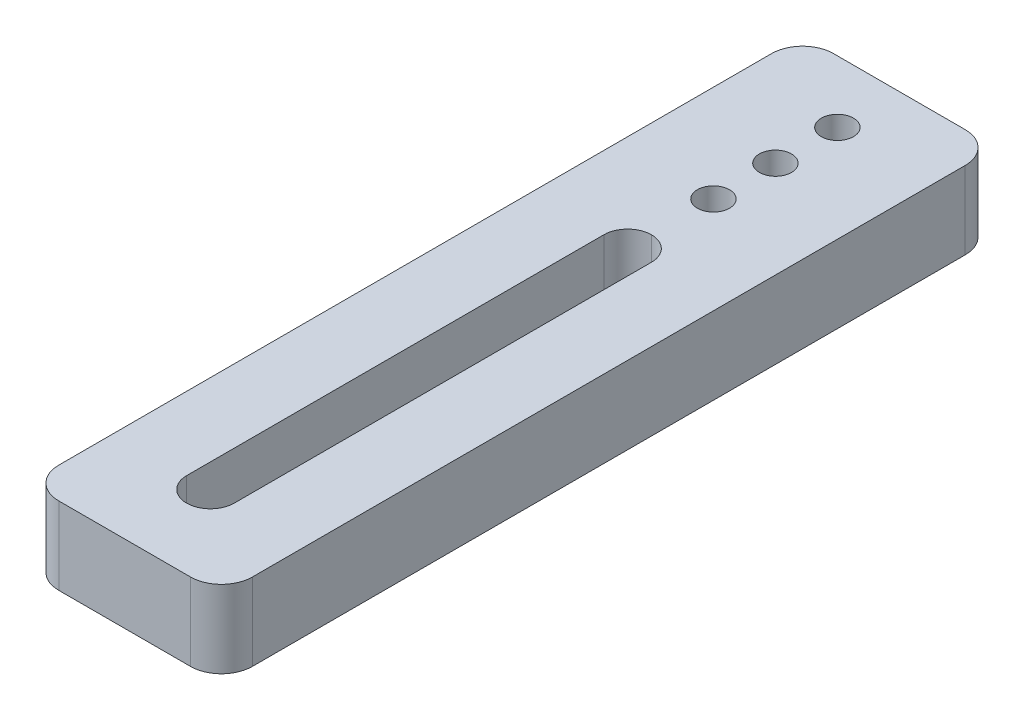
ISO-10303-21;
HEADER;
FILE_DESCRIPTION(('STEP AP214'),'2;1');
FILE_NAME('part.step','',(''),(''),'','','');
FILE_SCHEMA(('AUTOMOTIVE_DESIGN { 1 0 10303 214 1 1 1 1 }'));
ENDSEC;
DATA;
#1=APPLICATION_CONTEXT('core data for automotive mechanical design processes');
#2=APPLICATION_PROTOCOL_DEFINITION('international standard','automotive_design',2000,#1);
#3=PRODUCT_CONTEXT('',#1,'mechanical');
#4=PRODUCT('Part','Part','',(#3));
#5=PRODUCT_RELATED_PRODUCT_CATEGORY('part','',(#4));
#6=PRODUCT_DEFINITION_FORMATION('','',#4);
#7=PRODUCT_DEFINITION_CONTEXT('part definition',#1,'design');
#8=PRODUCT_DEFINITION('design','',#6,#7);
#9=PRODUCT_DEFINITION_SHAPE('','',#8);
#10=(LENGTH_UNIT() NAMED_UNIT(*) SI_UNIT(.MILLI.,.METRE.));
#11=(NAMED_UNIT(*) PLANE_ANGLE_UNIT() SI_UNIT($,.RADIAN.));
#12=(NAMED_UNIT(*) SI_UNIT($,.STERADIAN.) SOLID_ANGLE_UNIT());
#13=UNCERTAINTY_MEASURE_WITH_UNIT(LENGTH_MEASURE(1.E-05),#10,'distance_accuracy_value','');
#14=(GEOMETRIC_REPRESENTATION_CONTEXT(3) GLOBAL_UNCERTAINTY_ASSIGNED_CONTEXT((#13)) GLOBAL_UNIT_ASSIGNED_CONTEXT((#10,
#11,#12)) REPRESENTATION_CONTEXT('',''));
#15=CARTESIAN_POINT('',(0.,0.,0.));
#16=DIRECTION('',(0.,0.,1.));
#17=DIRECTION('',(1.,0.,0.));
#18=AXIS2_PLACEMENT_3D('',#15,#16,#17);
#19=CARTESIAN_POINT('',(0.,0.,-26.));
#20=DIRECTION('',(0.,1.,0.));
#21=DIRECTION('',(0.,0.,1.));
#22=AXIS2_PLACEMENT_3D('',#19,#20,#21);
#23=CYLINDRICAL_SURFACE('',#22,2.075);
#24=CARTESIAN_POINT('',(0.,0.,-26.));
#25=DIRECTION('',(0.,1.,0.));
#26=DIRECTION('',(0.,0.,1.));
#27=AXIS2_PLACEMENT_3D('',#24,#25,#26);
#28=CIRCLE('',#27,2.075);
#29=CARTESIAN_POINT('',(0.,0.,-23.925));
#30=VERTEX_POINT('',#29);
#31=EDGE_CURVE('E42',#30,#30,#28,.T.);
#32=ORIENTED_EDGE('',*,*,#31,.F.);
#33=EDGE_LOOP('',(#32));
#34=FACE_BOUND('',#33,.T.);
#35=CARTESIAN_POINT('',(0.,10.,-26.));
#36=DIRECTION('',(0.,1.,0.));
#37=DIRECTION('',(0.,0.,1.));
#38=AXIS2_PLACEMENT_3D('',#35,#36,#37);
#39=CIRCLE('',#38,2.075);
#40=CARTESIAN_POINT('',(0.,10.,-23.925));
#41=VERTEX_POINT('',#40);
#42=EDGE_CURVE('E11',#41,#41,#39,.T.);
#43=ORIENTED_EDGE('',*,*,#42,.T.);
#44=EDGE_LOOP('',(#43));
#45=FACE_BOUND('',#44,.T.);
#46=ADVANCED_FACE('F35',(#34,#45),#23,.F.);
#47=CARTESIAN_POINT('',(0.,10.,0.));
#48=DIRECTION('',(0.,-1.,0.));
#49=DIRECTION('',(0.,0.,-1.));
#50=AXIS2_PLACEMENT_3D('',#47,#48,#49);
#51=PLANE('',#50);
#52=CARTESIAN_POINT('',(0.,10.,-34.));
#53=DIRECTION('',(0.,1.,0.));
#54=DIRECTION('',(0.,0.,1.));
#55=AXIS2_PLACEMENT_3D('',#52,#53,#54);
#56=CIRCLE('',#55,2.075);
#57=CARTESIAN_POINT('',(0.,10.,-31.925));
#58=VERTEX_POINT('',#57);
#59=EDGE_CURVE('E350',#58,#58,#56,.T.);
#60=ORIENTED_EDGE('',*,*,#59,.F.);
#61=EDGE_LOOP('',(#60));
#62=FACE_BOUND('',#61,.T.);
#63=CARTESIAN_POINT('',(0.,10.,-42.));
#64=DIRECTION('',(0.,1.,0.));
#65=DIRECTION('',(0.,0.,1.));
#66=AXIS2_PLACEMENT_3D('',#63,#64,#65);
#67=CIRCLE('',#66,2.075);
#68=CARTESIAN_POINT('',(0.,10.,-39.925));
#69=VERTEX_POINT('',#68);
#70=EDGE_CURVE('E347',#69,#69,#67,.T.);
#71=ORIENTED_EDGE('',*,*,#70,.F.);
#72=EDGE_LOOP('',(#71));
#73=FACE_BOUND('',#72,.T.);
#74=DIRECTION('',(0.,0.,1.));
#75=VECTOR('',#74,1.);
#76=CARTESIAN_POINT('',(-12.5,10.,50.));
#77=LINE('',#76,#75);
#78=CARTESIAN_POINT('',(-12.5,10.,-46.));
#79=VERTEX_POINT('',#78);
#80=CARTESIAN_POINT('',(-12.5,10.,46.));
#81=VERTEX_POINT('',#80);
#82=EDGE_CURVE('E182',#79,#81,#77,.T.);
#83=ORIENTED_EDGE('',*,*,#82,.T.);
#84=CARTESIAN_POINT('',(-8.5,10.,46.));
#85=DIRECTION('',(0.,-1.,0.));
#86=DIRECTION('',(0.,0.,-1.));
#87=AXIS2_PLACEMENT_3D('',#84,#85,#86);
#88=CIRCLE('',#87,4.);
#89=CARTESIAN_POINT('',(-8.5,10.,50.));
#90=VERTEX_POINT('',#89);
#91=EDGE_CURVE('E237',#81,#90,#88,.F.);
#92=ORIENTED_EDGE('',*,*,#91,.T.);
#93=DIRECTION('',(1.,0.,0.));
#94=VECTOR('',#93,1.);
#95=CARTESIAN_POINT('',(-12.5,10.,50.));
#96=LINE('',#95,#94);
#97=CARTESIAN_POINT('',(8.5,10.,50.));
#98=VERTEX_POINT('',#97);
#99=EDGE_CURVE('E160',#90,#98,#96,.T.);
#100=ORIENTED_EDGE('',*,*,#99,.T.);
#101=CARTESIAN_POINT('',(8.5,10.,46.));
#102=DIRECTION('',(0.,-1.,0.));
#103=DIRECTION('',(0.,0.,-1.));
#104=AXIS2_PLACEMENT_3D('',#101,#102,#103);
#105=CIRCLE('',#104,4.);
#106=CARTESIAN_POINT('',(12.5,10.,46.));
#107=VERTEX_POINT('',#106);
#108=EDGE_CURVE('E235',#98,#107,#105,.F.);
#109=ORIENTED_EDGE('',*,*,#108,.T.);
#110=DIRECTION('',(0.,0.,-1.));
#111=VECTOR('',#110,1.);
#112=CARTESIAN_POINT('',(12.5,10.,50.));
#113=LINE('',#112,#111);
#114=CARTESIAN_POINT('',(12.5,10.,-46.));
#115=VERTEX_POINT('',#114);
#116=EDGE_CURVE('E177',#107,#115,#113,.T.);
#117=ORIENTED_EDGE('',*,*,#116,.T.);
#118=CARTESIAN_POINT('',(8.5,10.,-46.));
#119=DIRECTION('',(0.,-1.,0.));
#120=DIRECTION('',(0.,0.,-1.));
#121=AXIS2_PLACEMENT_3D('',#118,#119,#120);
#122=CIRCLE('',#121,4.);
#123=CARTESIAN_POINT('',(8.5,10.,-50.));
#124=VERTEX_POINT('',#123);
#125=EDGE_CURVE('E56',#115,#124,#122,.F.);
#126=ORIENTED_EDGE('',*,*,#125,.T.);
#127=DIRECTION('',(-1.,0.,0.));
#128=VECTOR('',#127,1.);
#129=CARTESIAN_POINT('',(-12.5,10.,-50.));
#130=LINE('',#129,#128);
#131=CARTESIAN_POINT('',(-8.5,10.,-50.));
#132=VERTEX_POINT('',#131);
#133=EDGE_CURVE('E179',#124,#132,#130,.T.);
#134=ORIENTED_EDGE('',*,*,#133,.T.);
#135=CARTESIAN_POINT('',(-8.5,10.,-46.));
#136=DIRECTION('',(0.,-1.,0.));
#137=DIRECTION('',(0.,0.,-1.));
#138=AXIS2_PLACEMENT_3D('',#135,#136,#137);
#139=CIRCLE('',#138,4.);
#140=EDGE_CURVE('E232',#132,#79,#139,.F.);
#141=ORIENTED_EDGE('',*,*,#140,.T.);
#142=EDGE_LOOP('',(#83,#92,#100,#109,#117,#126,#134,#141));
#143=FACE_BOUND('',#142,.T.);
#144=CARTESIAN_POINT('',(0.,10.,38.925));
#145=DIRECTION('',(0.,-1.,0.));
#146=DIRECTION('',(0.,0.,-1.));
#147=AXIS2_PLACEMENT_3D('',#144,#145,#146);
#148=CIRCLE('',#147,3.075);
#149=CARTESIAN_POINT('',(3.075,10.,38.925));
#150=VERTEX_POINT('',#149);
#151=CARTESIAN_POINT('',(0.,10.,42.));
#152=VERTEX_POINT('',#151);
#153=EDGE_CURVE('E137',#150,#152,#148,.T.);
#154=ORIENTED_EDGE('',*,*,#153,.T.);
#155=CARTESIAN_POINT('',(0.,10.,38.925));
#156=DIRECTION('',(0.,-1.,0.));
#157=DIRECTION('',(0.,0.,-1.));
#158=AXIS2_PLACEMENT_3D('',#155,#156,#157);
#159=CIRCLE('',#158,3.075);
#160=CARTESIAN_POINT('',(-3.075,10.,38.925));
#161=VERTEX_POINT('',#160);
#162=EDGE_CURVE('E207',#152,#161,#159,.T.);
#163=ORIENTED_EDGE('',*,*,#162,.T.);
#164=DIRECTION('',(0.,0.,-1.));
#165=VECTOR('',#164,1.);
#166=CARTESIAN_POINT('',(-3.075,10.,0.));
#167=LINE('',#166,#165);
#168=CARTESIAN_POINT('',(-3.075,10.,-14.925));
#169=VERTEX_POINT('',#168);
#170=EDGE_CURVE('E167',#161,#169,#167,.T.);
#171=ORIENTED_EDGE('',*,*,#170,.T.);
#172=CARTESIAN_POINT('',(0.,10.,-14.925));
#173=DIRECTION('',(0.,-1.,0.));
#174=DIRECTION('',(0.,0.,-1.));
#175=AXIS2_PLACEMENT_3D('',#172,#173,#174);
#176=CIRCLE('',#175,3.075);
#177=CARTESIAN_POINT('',(0.,10.,-18.));
#178=VERTEX_POINT('',#177);
#179=EDGE_CURVE('E203',#169,#178,#176,.T.);
#180=ORIENTED_EDGE('',*,*,#179,.T.);
#181=CARTESIAN_POINT('',(0.,10.,-14.925));
#182=DIRECTION('',(0.,-1.,0.));
#183=DIRECTION('',(0.,0.,-1.));
#184=AXIS2_PLACEMENT_3D('',#181,#182,#183);
#185=CIRCLE('',#184,3.075);
#186=CARTESIAN_POINT('',(3.075,10.,-14.925));
#187=VERTEX_POINT('',#186);
#188=EDGE_CURVE('E165',#178,#187,#185,.T.);
#189=ORIENTED_EDGE('',*,*,#188,.T.);
#190=DIRECTION('',(0.,0.,-1.));
#191=VECTOR('',#190,1.);
#192=CARTESIAN_POINT('',(3.075,10.,0.));
#193=LINE('',#192,#191);
#194=EDGE_CURVE('E155',#150,#187,#193,.T.);
#195=ORIENTED_EDGE('',*,*,#194,.F.);
#196=EDGE_LOOP('',(#154,#163,#171,#180,#189,#195));
#197=FACE_BOUND('',#196,.T.);
#198=ORIENTED_EDGE('',*,*,#42,.F.);
#199=EDGE_LOOP('',(#198));
#200=FACE_BOUND('',#199,.T.);
#201=ADVANCED_FACE('F162',(#62,#73,#143,#197,#200),#51,.F.);
#202=CARTESIAN_POINT('',(0.,0.,0.));
#203=DIRECTION('',(0.,-1.,0.));
#204=DIRECTION('',(0.,0.,-1.));
#205=AXIS2_PLACEMENT_3D('',#202,#203,#204);
#206=PLANE('',#205);
#207=CARTESIAN_POINT('',(0.,0.,-34.));
#208=DIRECTION('',(0.,1.,0.));
#209=DIRECTION('',(0.,0.,1.));
#210=AXIS2_PLACEMENT_3D('',#207,#208,#209);
#211=CIRCLE('',#210,2.075);
#212=CARTESIAN_POINT('',(0.,0.,-31.925));
#213=VERTEX_POINT('',#212);
#214=EDGE_CURVE('E355',#213,#213,#211,.T.);
#215=ORIENTED_EDGE('',*,*,#214,.T.);
#216=EDGE_LOOP('',(#215));
#217=FACE_BOUND('',#216,.T.);
#218=CARTESIAN_POINT('',(0.,0.,-42.));
#219=DIRECTION('',(0.,1.,0.));
#220=DIRECTION('',(0.,0.,1.));
#221=AXIS2_PLACEMENT_3D('',#218,#219,#220);
#222=CIRCLE('',#221,2.075);
#223=CARTESIAN_POINT('',(0.,0.,-39.925));
#224=VERTEX_POINT('',#223);
#225=EDGE_CURVE('E214',#224,#224,#222,.T.);
#226=ORIENTED_EDGE('',*,*,#225,.T.);
#227=EDGE_LOOP('',(#226));
#228=FACE_BOUND('',#227,.T.);
#229=DIRECTION('',(1.,0.,0.));
#230=VECTOR('',#229,1.);
#231=CARTESIAN_POINT('',(-12.5,0.,50.));
#232=LINE('',#231,#230);
#233=CARTESIAN_POINT('',(-8.5,0.,50.));
#234=VERTEX_POINT('',#233);
#235=CARTESIAN_POINT('',(8.5,0.,50.));
#236=VERTEX_POINT('',#235);
#237=EDGE_CURVE('E180',#234,#236,#232,.T.);
#238=ORIENTED_EDGE('',*,*,#237,.F.);
#239=CARTESIAN_POINT('',(-8.5,0.,46.));
#240=DIRECTION('',(0.,-1.,0.));
#241=DIRECTION('',(0.,0.,-1.));
#242=AXIS2_PLACEMENT_3D('',#239,#240,#241);
#243=CIRCLE('',#242,4.);
#244=CARTESIAN_POINT('',(-12.5,0.,46.));
#245=VERTEX_POINT('',#244);
#246=EDGE_CURVE('E225',#234,#245,#243,.T.);
#247=ORIENTED_EDGE('',*,*,#246,.T.);
#248=DIRECTION('',(0.,0.,1.));
#249=VECTOR('',#248,1.);
#250=CARTESIAN_POINT('',(-12.5,0.,50.));
#251=LINE('',#250,#249);
#252=CARTESIAN_POINT('',(-12.5,0.,-46.));
#253=VERTEX_POINT('',#252);
#254=EDGE_CURVE('E188',#253,#245,#251,.T.);
#255=ORIENTED_EDGE('',*,*,#254,.F.);
#256=CARTESIAN_POINT('',(-8.5,0.,-46.));
#257=DIRECTION('',(0.,-1.,0.));
#258=DIRECTION('',(0.,0.,-1.));
#259=AXIS2_PLACEMENT_3D('',#256,#257,#258);
#260=CIRCLE('',#259,4.);
#261=CARTESIAN_POINT('',(-8.5,0.,-50.));
#262=VERTEX_POINT('',#261);
#263=EDGE_CURVE('E219',#253,#262,#260,.T.);
#264=ORIENTED_EDGE('',*,*,#263,.T.);
#265=DIRECTION('',(-1.,0.,0.));
#266=VECTOR('',#265,1.);
#267=CARTESIAN_POINT('',(-12.5,0.,-50.));
#268=LINE('',#267,#266);
#269=CARTESIAN_POINT('',(8.5,0.,-50.));
#270=VERTEX_POINT('',#269);
#271=EDGE_CURVE('E170',#270,#262,#268,.T.);
#272=ORIENTED_EDGE('',*,*,#271,.F.);
#273=CARTESIAN_POINT('',(8.5,0.,-46.));
#274=DIRECTION('',(0.,-1.,0.));
#275=DIRECTION('',(0.,0.,-1.));
#276=AXIS2_PLACEMENT_3D('',#273,#274,#275);
#277=CIRCLE('',#276,4.);
#278=CARTESIAN_POINT('',(12.5,0.,-46.));
#279=VERTEX_POINT('',#278);
#280=EDGE_CURVE('E221',#270,#279,#277,.T.);
#281=ORIENTED_EDGE('',*,*,#280,.T.);
#282=DIRECTION('',(0.,0.,-1.));
#283=VECTOR('',#282,1.);
#284=CARTESIAN_POINT('',(12.5,0.,50.));
#285=LINE('',#284,#283);
#286=CARTESIAN_POINT('',(12.5,0.,46.));
#287=VERTEX_POINT('',#286);
#288=EDGE_CURVE('E166',#287,#279,#285,.T.);
#289=ORIENTED_EDGE('',*,*,#288,.F.);
#290=CARTESIAN_POINT('',(8.5,0.,46.));
#291=DIRECTION('',(0.,-1.,0.));
#292=DIRECTION('',(0.,0.,-1.));
#293=AXIS2_PLACEMENT_3D('',#290,#291,#292);
#294=CIRCLE('',#293,4.);
#295=EDGE_CURVE('E223',#287,#236,#294,.T.);
#296=ORIENTED_EDGE('',*,*,#295,.T.);
#297=EDGE_LOOP('',(#238,#247,#255,#264,#272,#281,#289,#296));
#298=FACE_BOUND('',#297,.T.);
#299=DIRECTION('',(0.,0.,-1.));
#300=VECTOR('',#299,1.);
#301=CARTESIAN_POINT('',(-3.075,0.,42.));
#302=LINE('',#301,#300);
#303=CARTESIAN_POINT('',(-3.075,0.,38.925));
#304=VERTEX_POINT('',#303);
#305=CARTESIAN_POINT('',(-3.075,0.,-14.925));
#306=VERTEX_POINT('',#305);
#307=EDGE_CURVE('E173',#304,#306,#302,.T.);
#308=ORIENTED_EDGE('',*,*,#307,.F.);
#309=CARTESIAN_POINT('',(0.,0.,38.925));
#310=DIRECTION('',(0.,-1.,0.));
#311=DIRECTION('',(0.,0.,-1.));
#312=AXIS2_PLACEMENT_3D('',#309,#310,#311);
#313=CIRCLE('',#312,3.075);
#314=CARTESIAN_POINT('',(0.,0.,42.));
#315=VERTEX_POINT('',#314);
#316=EDGE_CURVE('E147',#304,#315,#313,.F.);
#317=ORIENTED_EDGE('',*,*,#316,.T.);
#318=CARTESIAN_POINT('',(0.,0.,38.925));
#319=DIRECTION('',(0.,-1.,0.));
#320=DIRECTION('',(0.,0.,-1.));
#321=AXIS2_PLACEMENT_3D('',#318,#319,#320);
#322=CIRCLE('',#321,3.075);
#323=CARTESIAN_POINT('',(3.075,0.,38.925));
#324=VERTEX_POINT('',#323);
#325=EDGE_CURVE('E148',#315,#324,#322,.F.);
#326=ORIENTED_EDGE('',*,*,#325,.T.);
#327=DIRECTION('',(0.,0.,-1.));
#328=VECTOR('',#327,1.);
#329=CARTESIAN_POINT('',(3.075,0.,42.));
#330=LINE('',#329,#328);
#331=CARTESIAN_POINT('',(3.075,0.,-14.925));
#332=VERTEX_POINT('',#331);
#333=EDGE_CURVE('E158',#324,#332,#330,.T.);
#334=ORIENTED_EDGE('',*,*,#333,.T.);
#335=CARTESIAN_POINT('',(0.,0.,-14.925));
#336=DIRECTION('',(0.,-1.,0.));
#337=DIRECTION('',(0.,0.,-1.));
#338=AXIS2_PLACEMENT_3D('',#335,#336,#337);
#339=CIRCLE('',#338,3.075);
#340=CARTESIAN_POINT('',(0.,0.,-18.));
#341=VERTEX_POINT('',#340);
#342=EDGE_CURVE('E198',#332,#341,#339,.F.);
#343=ORIENTED_EDGE('',*,*,#342,.T.);
#344=CARTESIAN_POINT('',(0.,0.,-14.925));
#345=DIRECTION('',(0.,-1.,0.));
#346=DIRECTION('',(0.,0.,-1.));
#347=AXIS2_PLACEMENT_3D('',#344,#345,#346);
#348=CIRCLE('',#347,3.075);
#349=EDGE_CURVE('E201',#341,#306,#348,.F.);
#350=ORIENTED_EDGE('',*,*,#349,.T.);
#351=EDGE_LOOP('',(#308,#317,#326,#334,#343,#350));
#352=FACE_BOUND('',#351,.T.);
#353=ORIENTED_EDGE('',*,*,#31,.T.);
#354=EDGE_LOOP('',(#353));
#355=FACE_BOUND('',#354,.T.);
#356=ADVANCED_FACE('F250',(#217,#228,#298,#352,#355),#206,.T.);
#357=CARTESIAN_POINT('',(12.5,10.,50.));
#358=DIRECTION('',(-1.,0.,0.));
#359=DIRECTION('',(0.,0.,1.));
#360=AXIS2_PLACEMENT_3D('',#357,#358,#359);
#361=PLANE('',#360);
#362=ORIENTED_EDGE('',*,*,#116,.F.);
#363=DIRECTION('',(0.,-1.,0.));
#364=VECTOR('',#363,1.);
#365=CARTESIAN_POINT('',(12.5,10.,46.));
#366=LINE('',#365,#364);
#367=EDGE_CURVE('E241',#107,#287,#366,.T.);
#368=ORIENTED_EDGE('',*,*,#367,.T.);
#369=ORIENTED_EDGE('',*,*,#288,.T.);
#370=DIRECTION('',(0.,-1.,0.));
#371=VECTOR('',#370,1.);
#372=CARTESIAN_POINT('',(12.5,10.,-46.));
#373=LINE('',#372,#371);
#374=EDGE_CURVE('E239',#279,#115,#373,.F.);
#375=ORIENTED_EDGE('',*,*,#374,.T.);
#376=EDGE_LOOP('',(#362,#368,#369,#375));
#377=FACE_BOUND('',#376,.T.);
#378=ADVANCED_FACE('F261',(#377),#361,.F.);
#379=CARTESIAN_POINT('',(-12.5,10.,-50.));
#380=DIRECTION('',(0.,0.,1.));
#381=DIRECTION('',(1.,0.,0.));
#382=AXIS2_PLACEMENT_3D('',#379,#380,#381);
#383=PLANE('',#382);
#384=ORIENTED_EDGE('',*,*,#133,.F.);
#385=DIRECTION('',(0.,-1.,0.));
#386=VECTOR('',#385,1.);
#387=CARTESIAN_POINT('',(8.5,10.,-50.));
#388=LINE('',#387,#386);
#389=EDGE_CURVE('E245',#124,#270,#388,.T.);
#390=ORIENTED_EDGE('',*,*,#389,.T.);
#391=ORIENTED_EDGE('',*,*,#271,.T.);
#392=DIRECTION('',(0.,-1.,0.));
#393=VECTOR('',#392,1.);
#394=CARTESIAN_POINT('',(-8.5,10.,-50.));
#395=LINE('',#394,#393);
#396=EDGE_CURVE('E49',#262,#132,#395,.F.);
#397=ORIENTED_EDGE('',*,*,#396,.T.);
#398=EDGE_LOOP('',(#384,#390,#391,#397));
#399=FACE_BOUND('',#398,.T.);
#400=ADVANCED_FACE('F276',(#399),#383,.F.);
#401=CARTESIAN_POINT('',(-12.5,10.,50.));
#402=DIRECTION('',(1.,0.,0.));
#403=DIRECTION('',(0.,0.,-1.));
#404=AXIS2_PLACEMENT_3D('',#401,#402,#403);
#405=PLANE('',#404);
#406=ORIENTED_EDGE('',*,*,#254,.T.);
#407=DIRECTION('',(0.,-1.,0.));
#408=VECTOR('',#407,1.);
#409=CARTESIAN_POINT('',(-12.5,10.,46.));
#410=LINE('',#409,#408);
#411=EDGE_CURVE('E230',#245,#81,#410,.F.);
#412=ORIENTED_EDGE('',*,*,#411,.T.);
#413=ORIENTED_EDGE('',*,*,#82,.F.);
#414=DIRECTION('',(0.,-1.,0.));
#415=VECTOR('',#414,1.);
#416=CARTESIAN_POINT('',(-12.5,10.,-46.));
#417=LINE('',#416,#415);
#418=EDGE_CURVE('E227',#79,#253,#417,.T.);
#419=ORIENTED_EDGE('',*,*,#418,.T.);
#420=EDGE_LOOP('',(#406,#412,#413,#419));
#421=FACE_BOUND('',#420,.T.);
#422=ADVANCED_FACE('F272',(#421),#405,.F.);
#423=CARTESIAN_POINT('',(-12.5,10.,50.));
#424=DIRECTION('',(0.,0.,-1.));
#425=DIRECTION('',(-1.,0.,0.));
#426=AXIS2_PLACEMENT_3D('',#423,#424,#425);
#427=PLANE('',#426);
#428=ORIENTED_EDGE('',*,*,#99,.F.);
#429=DIRECTION('',(0.,-1.,0.));
#430=VECTOR('',#429,1.);
#431=CARTESIAN_POINT('',(-8.5,10.,50.));
#432=LINE('',#431,#430);
#433=EDGE_CURVE('E216',#90,#234,#432,.T.);
#434=ORIENTED_EDGE('',*,*,#433,.T.);
#435=ORIENTED_EDGE('',*,*,#237,.T.);
#436=DIRECTION('',(0.,-1.,0.));
#437=VECTOR('',#436,1.);
#438=CARTESIAN_POINT('',(8.5,10.,50.));
#439=LINE('',#438,#437);
#440=EDGE_CURVE('E209',#236,#98,#439,.F.);
#441=ORIENTED_EDGE('',*,*,#440,.T.);
#442=EDGE_LOOP('',(#428,#434,#435,#441));
#443=FACE_BOUND('',#442,.T.);
#444=ADVANCED_FACE('F269',(#443),#427,.F.);
#445=CARTESIAN_POINT('',(3.075,10.000012,42.));
#446=DIRECTION('',(-1.,0.,0.));
#447=DIRECTION('',(0.,0.,1.));
#448=AXIS2_PLACEMENT_3D('',#445,#446,#447);
#449=PLANE('',#448);
#450=ORIENTED_EDGE('',*,*,#194,.T.);
#451=DIRECTION('',(0.,-1.,0.));
#452=VECTOR('',#451,1.);
#453=CARTESIAN_POINT('',(3.075,10.000012,-14.925));
#454=LINE('',#453,#452);
#455=EDGE_CURVE('E159',#187,#332,#454,.T.);
#456=ORIENTED_EDGE('',*,*,#455,.T.);
#457=ORIENTED_EDGE('',*,*,#333,.F.);
#458=DIRECTION('',(0.,-1.,0.));
#459=VECTOR('',#458,1.);
#460=CARTESIAN_POINT('',(3.075,10.000012,38.925));
#461=LINE('',#460,#459);
#462=EDGE_CURVE('E141',#324,#150,#461,.F.);
#463=ORIENTED_EDGE('',*,*,#462,.T.);
#464=EDGE_LOOP('',(#450,#456,#457,#463));
#465=FACE_BOUND('',#464,.T.);
#466=ADVANCED_FACE('F153',(#465),#449,.T.);
#467=CARTESIAN_POINT('',(-3.075,10.000012,42.));
#468=DIRECTION('',(-1.,0.,0.));
#469=DIRECTION('',(0.,0.,1.));
#470=AXIS2_PLACEMENT_3D('',#467,#468,#469);
#471=PLANE('',#470);
#472=ORIENTED_EDGE('',*,*,#307,.T.);
#473=DIRECTION('',(0.,-1.,0.));
#474=VECTOR('',#473,1.);
#475=CARTESIAN_POINT('',(-3.075,10.,-14.925));
#476=LINE('',#475,#474);
#477=EDGE_CURVE('E196',#306,#169,#476,.F.);
#478=ORIENTED_EDGE('',*,*,#477,.T.);
#479=ORIENTED_EDGE('',*,*,#170,.F.);
#480=DIRECTION('',(0.,-1.,0.));
#481=VECTOR('',#480,1.);
#482=CARTESIAN_POINT('',(-3.075,0.,38.925));
#483=LINE('',#482,#481);
#484=EDGE_CURVE('E194',#161,#304,#483,.T.);
#485=ORIENTED_EDGE('',*,*,#484,.T.);
#486=EDGE_LOOP('',(#472,#478,#479,#485));
#487=FACE_BOUND('',#486,.T.);
#488=ADVANCED_FACE('F291',(#487),#471,.F.);
#489=CARTESIAN_POINT('',(0.,10.000012,-14.925));
#490=DIRECTION('',(0.,1.,0.));
#491=DIRECTION('',(0.,0.,1.));
#492=AXIS2_PLACEMENT_3D('',#489,#490,#491);
#493=CYLINDRICAL_SURFACE('',#492,3.075);
#494=DIRECTION('',(0.,-1.,0.));
#495=VECTOR('',#494,1.);
#496=CARTESIAN_POINT('',(0.,0.,-18.));
#497=LINE('',#496,#495);
#498=EDGE_CURVE('E210',#178,#341,#497,.T.);
#499=ORIENTED_EDGE('',*,*,#498,.F.);
#500=ORIENTED_EDGE('',*,*,#179,.F.);
#501=ORIENTED_EDGE('',*,*,#477,.F.);
#502=ORIENTED_EDGE('',*,*,#349,.F.);
#503=EDGE_LOOP('',(#499,#500,#501,#502));
#504=FACE_BOUND('',#503,.T.);
#505=ADVANCED_FACE('F287',(#504),#493,.F.);
#506=CARTESIAN_POINT('',(0.,10.000012,-14.925));
#507=DIRECTION('',(0.,-1.,0.));
#508=DIRECTION('',(0.,0.,-1.));
#509=AXIS2_PLACEMENT_3D('',#506,#507,#508);
#510=CYLINDRICAL_SURFACE('',#509,3.075);
#511=ORIENTED_EDGE('',*,*,#188,.F.);
#512=ORIENTED_EDGE('',*,*,#498,.T.);
#513=ORIENTED_EDGE('',*,*,#342,.F.);
#514=ORIENTED_EDGE('',*,*,#455,.F.);
#515=EDGE_LOOP('',(#511,#512,#513,#514));
#516=FACE_BOUND('',#515,.T.);
#517=ADVANCED_FACE('F283',(#516),#510,.F.);
#518=CARTESIAN_POINT('',(0.,10.000012,38.925));
#519=DIRECTION('',(0.,1.,0.));
#520=DIRECTION('',(0.,0.,1.));
#521=AXIS2_PLACEMENT_3D('',#518,#519,#520);
#522=CYLINDRICAL_SURFACE('',#521,3.075);
#523=ORIENTED_EDGE('',*,*,#484,.F.);
#524=ORIENTED_EDGE('',*,*,#162,.F.);
#525=DIRECTION('',(0.,-1.,0.));
#526=VECTOR('',#525,1.);
#527=CARTESIAN_POINT('',(0.,10.,42.));
#528=LINE('',#527,#526);
#529=EDGE_CURVE('E143',#315,#152,#528,.F.);
#530=ORIENTED_EDGE('',*,*,#529,.F.);
#531=ORIENTED_EDGE('',*,*,#316,.F.);
#532=EDGE_LOOP('',(#523,#524,#530,#531));
#533=FACE_BOUND('',#532,.T.);
#534=ADVANCED_FACE('F286',(#533),#522,.F.);
#535=CARTESIAN_POINT('',(0.,10.000012,38.925));
#536=DIRECTION('',(0.,-1.,0.));
#537=DIRECTION('',(0.,0.,-1.));
#538=AXIS2_PLACEMENT_3D('',#535,#536,#537);
#539=CYLINDRICAL_SURFACE('',#538,3.075);
#540=ORIENTED_EDGE('',*,*,#153,.F.);
#541=ORIENTED_EDGE('',*,*,#462,.F.);
#542=ORIENTED_EDGE('',*,*,#325,.F.);
#543=ORIENTED_EDGE('',*,*,#529,.T.);
#544=EDGE_LOOP('',(#540,#541,#542,#543));
#545=FACE_BOUND('',#544,.T.);
#546=ADVANCED_FACE('F139',(#545),#539,.F.);
#547=CARTESIAN_POINT('',(-8.5,10.,46.));
#548=DIRECTION('',(0.,-1.,0.));
#549=DIRECTION('',(0.,0.,-1.));
#550=AXIS2_PLACEMENT_3D('',#547,#548,#549);
#551=CYLINDRICAL_SURFACE('',#550,4.);
#552=ORIENTED_EDGE('',*,*,#91,.F.);
#553=ORIENTED_EDGE('',*,*,#411,.F.);
#554=ORIENTED_EDGE('',*,*,#246,.F.);
#555=ORIENTED_EDGE('',*,*,#433,.F.);
#556=EDGE_LOOP('',(#552,#553,#554,#555));
#557=FACE_BOUND('',#556,.T.);
#558=ADVANCED_FACE('F295',(#557),#551,.T.);
#559=CARTESIAN_POINT('',(8.5,10.,46.));
#560=DIRECTION('',(0.,-1.,0.));
#561=DIRECTION('',(0.,0.,-1.));
#562=AXIS2_PLACEMENT_3D('',#559,#560,#561);
#563=CYLINDRICAL_SURFACE('',#562,4.);
#564=ORIENTED_EDGE('',*,*,#108,.F.);
#565=ORIENTED_EDGE('',*,*,#440,.F.);
#566=ORIENTED_EDGE('',*,*,#295,.F.);
#567=ORIENTED_EDGE('',*,*,#367,.F.);
#568=EDGE_LOOP('',(#564,#565,#566,#567));
#569=FACE_BOUND('',#568,.T.);
#570=ADVANCED_FACE('F301',(#569),#563,.T.);
#571=CARTESIAN_POINT('',(8.5,10.,-46.));
#572=DIRECTION('',(0.,-1.,0.));
#573=DIRECTION('',(0.,0.,-1.));
#574=AXIS2_PLACEMENT_3D('',#571,#572,#573);
#575=CYLINDRICAL_SURFACE('',#574,4.);
#576=ORIENTED_EDGE('',*,*,#125,.F.);
#577=ORIENTED_EDGE('',*,*,#374,.F.);
#578=ORIENTED_EDGE('',*,*,#280,.F.);
#579=ORIENTED_EDGE('',*,*,#389,.F.);
#580=EDGE_LOOP('',(#576,#577,#578,#579));
#581=FACE_BOUND('',#580,.T.);
#582=ADVANCED_FACE('F305',(#581),#575,.T.);
#583=CARTESIAN_POINT('',(-8.5,10.,-46.));
#584=DIRECTION('',(0.,-1.,0.));
#585=DIRECTION('',(0.,0.,-1.));
#586=AXIS2_PLACEMENT_3D('',#583,#584,#585);
#587=CYLINDRICAL_SURFACE('',#586,4.);
#588=ORIENTED_EDGE('',*,*,#140,.F.);
#589=ORIENTED_EDGE('',*,*,#396,.F.);
#590=ORIENTED_EDGE('',*,*,#263,.F.);
#591=ORIENTED_EDGE('',*,*,#418,.F.);
#592=EDGE_LOOP('',(#588,#589,#590,#591));
#593=FACE_BOUND('',#592,.T.);
#594=ADVANCED_FACE('F308',(#593),#587,.T.);
#595=CARTESIAN_POINT('',(0.,0.,-42.));
#596=DIRECTION('',(0.,1.,0.));
#597=DIRECTION('',(0.,0.,1.));
#598=AXIS2_PLACEMENT_3D('',#595,#596,#597);
#599=CYLINDRICAL_SURFACE('',#598,2.075);
#600=ORIENTED_EDGE('',*,*,#225,.F.);
#601=EDGE_LOOP('',(#600));
#602=FACE_BOUND('',#601,.T.);
#603=ORIENTED_EDGE('',*,*,#70,.T.);
#604=EDGE_LOOP('',(#603));
#605=FACE_BOUND('',#604,.T.);
#606=ADVANCED_FACE('F311',(#602,#605),#599,.F.);
#607=CARTESIAN_POINT('',(0.,0.,-34.));
#608=DIRECTION('',(0.,1.,0.));
#609=DIRECTION('',(0.,0.,1.));
#610=AXIS2_PLACEMENT_3D('',#607,#608,#609);
#611=CYLINDRICAL_SURFACE('',#610,2.075);
#612=ORIENTED_EDGE('',*,*,#214,.F.);
#613=EDGE_LOOP('',(#612));
#614=FACE_BOUND('',#613,.T.);
#615=ORIENTED_EDGE('',*,*,#59,.T.);
#616=EDGE_LOOP('',(#615));
#617=FACE_BOUND('',#616,.T.);
#618=ADVANCED_FACE('F316',(#614,#617),#611,.F.);
#619=CLOSED_SHELL('',(#46,#201,#356,#378,#400,#422,#444,#466,#488,#505,#517,#534,#546,#558,#570,
#582,#594,#606,#618));
#620=MANIFOLD_SOLID_BREP('B2',#619);
#621=ADVANCED_BREP_SHAPE_REPRESENTATION('',(#18,#620),#14);
#622=SHAPE_DEFINITION_REPRESENTATION(#9,#621);
ENDSEC;
END-ISO-10303-21;
